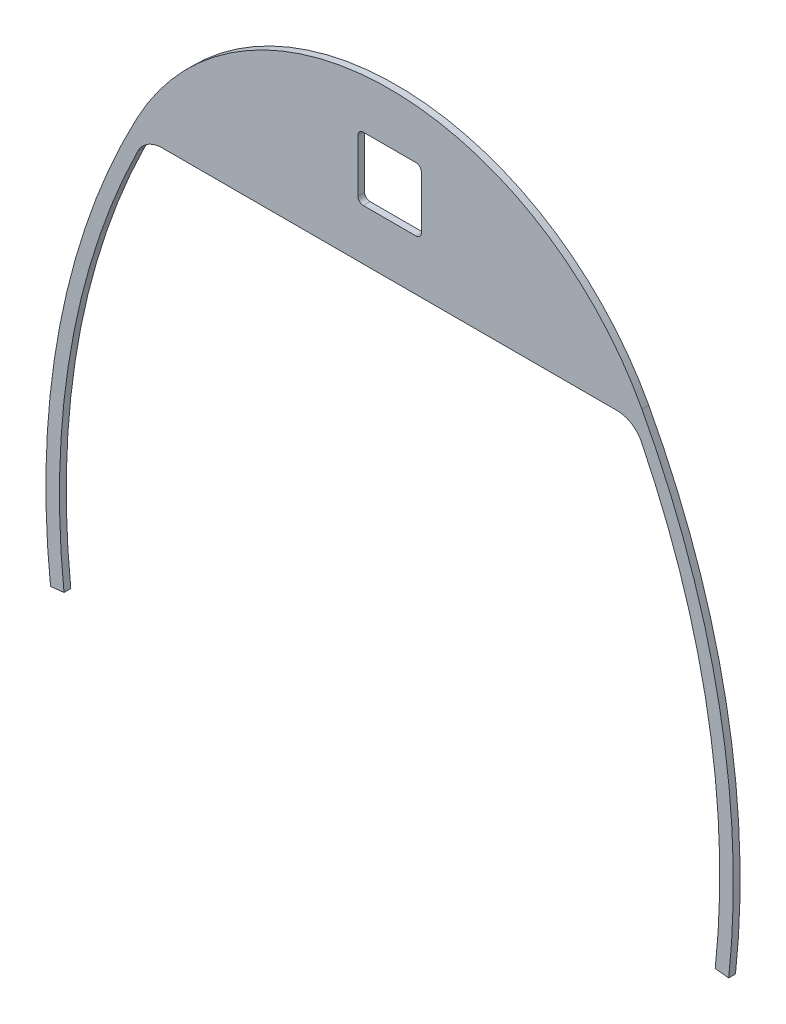
ISO-10303-21;
HEADER;
FILE_DESCRIPTION(('STEP AP214'),'2;1');
FILE_NAME('part.step','',(''),(''),'','','');
FILE_SCHEMA(('AUTOMOTIVE_DESIGN { 1 0 10303 214 1 1 1 1 }'));
ENDSEC;
DATA;
#1=APPLICATION_CONTEXT('core data for automotive mechanical design processes');
#2=APPLICATION_PROTOCOL_DEFINITION('international standard','automotive_design',2000,#1);
#3=PRODUCT_CONTEXT('',#1,'mechanical');
#4=PRODUCT('Part','Part','',(#3));
#5=PRODUCT_RELATED_PRODUCT_CATEGORY('part','',(#4));
#6=PRODUCT_DEFINITION_FORMATION('','',#4);
#7=PRODUCT_DEFINITION_CONTEXT('part definition',#1,'design');
#8=PRODUCT_DEFINITION('design','',#6,#7);
#9=PRODUCT_DEFINITION_SHAPE('','',#8);
#10=(LENGTH_UNIT() NAMED_UNIT(*) SI_UNIT(.MILLI.,.METRE.));
#11=(NAMED_UNIT(*) PLANE_ANGLE_UNIT() SI_UNIT($,.RADIAN.));
#12=(NAMED_UNIT(*) SI_UNIT($,.STERADIAN.) SOLID_ANGLE_UNIT());
#13=UNCERTAINTY_MEASURE_WITH_UNIT(LENGTH_MEASURE(1.E-05),#10,'distance_accuracy_value','');
#14=(GEOMETRIC_REPRESENTATION_CONTEXT(3) GLOBAL_UNCERTAINTY_ASSIGNED_CONTEXT((#13)) GLOBAL_UNIT_ASSIGNED_CONTEXT((#10,
#11,#12)) REPRESENTATION_CONTEXT('',''));
#15=CARTESIAN_POINT('',(0.,0.,0.));
#16=DIRECTION('',(0.,0.,1.));
#17=DIRECTION('',(1.,0.,0.));
#18=AXIS2_PLACEMENT_3D('',#15,#16,#17);
#19=CARTESIAN_POINT('',(0.,146.394206229881,3.175));
#20=DIRECTION('',(0.,0.,-1.));
#21=DIRECTION('',(-1.,0.,0.));
#22=AXIS2_PLACEMENT_3D('',#19,#20,#21);
#23=CYLINDRICAL_SURFACE('',#22,133.951547172083);
#24=CARTESIAN_POINT('',(0.,146.394206229881,0.));
#25=DIRECTION('',(0.,0.,1.));
#26=DIRECTION('',(1.,0.,0.));
#27=AXIS2_PLACEMENT_3D('',#24,#25,#26);
#28=CIRCLE('',#27,133.951547172083);
#29=CARTESIAN_POINT('',(-118.128585461186,209.55,0.));
#30=VERTEX_POINT('',#29);
#31=CARTESIAN_POINT('',(118.128585461186,209.55,0.));
#32=VERTEX_POINT('',#31);
#33=EDGE_CURVE('E195',#30,#32,#28,.F.);
#34=ORIENTED_EDGE('',*,*,#33,.F.);
#35=DIRECTION('',(0.,0.,-1.));
#36=VECTOR('',#35,1.);
#37=CARTESIAN_POINT('',(-118.128585461186,209.55,3.175));
#38=LINE('',#37,#36);
#39=CARTESIAN_POINT('',(-118.128585461186,209.55,3.175));
#40=VERTEX_POINT('',#39);
#41=EDGE_CURVE('E190',#40,#30,#38,.T.);
#42=ORIENTED_EDGE('',*,*,#41,.F.);
#43=CARTESIAN_POINT('',(0.,146.394206229881,3.175));
#44=DIRECTION('',(0.,0.,1.));
#45=DIRECTION('',(1.,0.,0.));
#46=AXIS2_PLACEMENT_3D('',#43,#44,#45);
#47=CIRCLE('',#46,133.951547172083);
#48=CARTESIAN_POINT('',(118.128585461186,209.55,3.175));
#49=VERTEX_POINT('',#48);
#50=EDGE_CURVE('E193',#40,#49,#47,.F.);
#51=ORIENTED_EDGE('',*,*,#50,.T.);
#52=DIRECTION('',(0.,0.,-1.));
#53=VECTOR('',#52,1.);
#54=CARTESIAN_POINT('',(118.128585461186,209.55,3.175));
#55=LINE('',#54,#53);
#56=EDGE_CURVE('E199',#49,#32,#55,.T.);
#57=ORIENTED_EDGE('',*,*,#56,.T.);
#58=EDGE_LOOP('',(#34,#42,#51,#57));
#59=FACE_BOUND('',#58,.T.);
#60=ADVANCED_FACE('F67',(#59),#23,.T.);
#61=CARTESIAN_POINT('',(0.,0.,3.175));
#62=DIRECTION('',(0.,0.,1.));
#63=DIRECTION('',(1.,0.,0.));
#64=AXIS2_PLACEMENT_3D('',#61,#62,#63);
#65=PLANE('',#64);
#66=DIRECTION('',(0.,1.,0.));
#67=VECTOR('',#66,1.);
#68=CARTESIAN_POINT('',(14.859,256.631876700982,3.175));
#69=LINE('',#68,#67);
#70=CARTESIAN_POINT('',(14.859,229.453876700982,3.175));
#71=VERTEX_POINT('',#70);
#72=CARTESIAN_POINT('',(14.859,254.091876700982,3.175));
#73=VERTEX_POINT('',#72);
#74=EDGE_CURVE('E499',#71,#73,#69,.T.);
#75=ORIENTED_EDGE('',*,*,#74,.F.);
#76=CARTESIAN_POINT('',(12.319,229.453876700982,3.175));
#77=DIRECTION('',(0.,0.,1.));
#78=DIRECTION('',(1.,0.,0.));
#79=AXIS2_PLACEMENT_3D('',#76,#77,#78);
#80=CIRCLE('',#79,2.54);
#81=CARTESIAN_POINT('',(12.319,226.913876700982,3.175));
#82=VERTEX_POINT('',#81);
#83=EDGE_CURVE('E279',#71,#82,#80,.F.);
#84=ORIENTED_EDGE('',*,*,#83,.T.);
#85=DIRECTION('',(1.,0.,0.));
#86=VECTOR('',#85,1.);
#87=CARTESIAN_POINT('',(-14.859,226.913876700982,3.175));
#88=LINE('',#87,#86);
#89=CARTESIAN_POINT('',(-12.319,226.913876700982,3.175));
#90=VERTEX_POINT('',#89);
#91=EDGE_CURVE('E516',#90,#82,#88,.T.);
#92=ORIENTED_EDGE('',*,*,#91,.F.);
#93=CARTESIAN_POINT('',(-12.319,229.453876700982,3.175));
#94=DIRECTION('',(0.,0.,1.));
#95=DIRECTION('',(1.,0.,0.));
#96=AXIS2_PLACEMENT_3D('',#93,#94,#95);
#97=CIRCLE('',#96,2.54);
#98=CARTESIAN_POINT('',(-14.859,229.453876700982,3.175));
#99=VERTEX_POINT('',#98);
#100=EDGE_CURVE('E291',#90,#99,#97,.F.);
#101=ORIENTED_EDGE('',*,*,#100,.T.);
#102=DIRECTION('',(0.,-1.,0.));
#103=VECTOR('',#102,1.);
#104=CARTESIAN_POINT('',(-14.859,256.631876700982,3.175));
#105=LINE('',#104,#103);
#106=CARTESIAN_POINT('',(-14.859,254.091876700982,3.175));
#107=VERTEX_POINT('',#106);
#108=EDGE_CURVE('E508',#107,#99,#105,.T.);
#109=ORIENTED_EDGE('',*,*,#108,.F.);
#110=CARTESIAN_POINT('',(-12.319,254.091876700982,3.175));
#111=DIRECTION('',(0.,0.,1.));
#112=DIRECTION('',(1.,0.,0.));
#113=AXIS2_PLACEMENT_3D('',#110,#111,#112);
#114=CIRCLE('',#113,2.54);
#115=CARTESIAN_POINT('',(-12.319,256.631876700982,3.175));
#116=VERTEX_POINT('',#115);
#117=EDGE_CURVE('E287',#107,#116,#114,.F.);
#118=ORIENTED_EDGE('',*,*,#117,.T.);
#119=DIRECTION('',(-1.,0.,0.));
#120=VECTOR('',#119,1.);
#121=CARTESIAN_POINT('',(-14.859,256.631876700982,3.175));
#122=LINE('',#121,#120);
#123=CARTESIAN_POINT('',(12.319,256.631876700982,3.175));
#124=VERTEX_POINT('',#123);
#125=EDGE_CURVE('E504',#124,#116,#122,.T.);
#126=ORIENTED_EDGE('',*,*,#125,.F.);
#127=CARTESIAN_POINT('',(12.319,254.091876700982,3.175));
#128=DIRECTION('',(0.,0.,1.));
#129=DIRECTION('',(1.,0.,0.));
#130=AXIS2_PLACEMENT_3D('',#127,#128,#129);
#131=CIRCLE('',#130,2.54);
#132=EDGE_CURVE('E283',#124,#73,#131,.F.);
#133=ORIENTED_EDGE('',*,*,#132,.T.);
#134=EDGE_LOOP('',(#75,#84,#92,#101,#109,#118,#126,#133));
#135=FACE_BOUND('',#134,.T.);
#136=ORIENTED_EDGE('',*,*,#50,.F.);
#137=CARTESIAN_POINT('',(201.066245881437,38.8969538972305,3.175));
#138=DIRECTION('',(0.,0.,1.));
#139=DIRECTION('',(1.,0.,0.));
#140=AXIS2_PLACEMENT_3D('',#137,#138,#139);
#141=CIRCLE('',#140,361.95);
#142=CARTESIAN_POINT('',(-158.711897247883,-0.69458846245031,3.175));
#143=VERTEX_POINT('',#142);
#144=EDGE_CURVE('E202',#40,#143,#141,.T.);
#145=ORIENTED_EDGE('',*,*,#144,.T.);
#146=DIRECTION('',(0.993999566595719,0.109384009834719,0.));
#147=VECTOR('',#146,1.);
#148=CARTESIAN_POINT('',(-158.711897247883,-0.69458846245047,3.175));
#149=LINE('',#148,#147);
#150=CARTESIAN_POINT('',(-152.4,0.,3.175));
#151=VERTEX_POINT('',#150);
#152=EDGE_CURVE('E210',#143,#151,#149,.T.);
#153=ORIENTED_EDGE('',*,*,#152,.T.);
#154=CARTESIAN_POINT('',(201.066245881437,38.8969538972305,3.175));
#155=DIRECTION('',(0.,0.,1.));
#156=DIRECTION('',(1.,0.,0.));
#157=AXIS2_PLACEMENT_3D('',#154,#155,#156);
#158=CIRCLE('',#157,355.6);
#159=CARTESIAN_POINT('',(-117.891225788818,196.114927633436,3.175));
#160=VERTEX_POINT('',#159);
#161=EDGE_CURVE('E232',#160,#151,#158,.T.);
#162=ORIENTED_EDGE('',*,*,#161,.F.);
#163=CARTESIAN_POINT('',(-106.49988751488,190.5,3.175));
#164=DIRECTION('',(0.,0.,1.));
#165=DIRECTION('',(1.,0.,0.));
#166=AXIS2_PLACEMENT_3D('',#163,#164,#165);
#167=CIRCLE('',#166,12.7);
#168=CARTESIAN_POINT('',(-106.49988751488,203.2,3.175));
#169=VERTEX_POINT('',#168);
#170=EDGE_CURVE('E12',#160,#169,#167,.F.);
#171=ORIENTED_EDGE('',*,*,#170,.T.);
#172=DIRECTION('',(1.,0.,0.));
#173=VECTOR('',#172,1.);
#174=CARTESIAN_POINT('',(-114.3,203.2,3.175));
#175=LINE('',#174,#173);
#176=CARTESIAN_POINT('',(106.49988751488,203.2,3.175));
#177=VERTEX_POINT('',#176);
#178=EDGE_CURVE('E229',#169,#177,#175,.T.);
#179=ORIENTED_EDGE('',*,*,#178,.T.);
#180=CARTESIAN_POINT('',(106.49988751488,190.5,3.175));
#181=DIRECTION('',(0.,0.,1.));
#182=DIRECTION('',(1.,0.,0.));
#183=AXIS2_PLACEMENT_3D('',#180,#181,#182);
#184=CIRCLE('',#183,12.7);
#185=CARTESIAN_POINT('',(117.891225788818,196.114927633436,3.175));
#186=VERTEX_POINT('',#185);
#187=EDGE_CURVE('E306',#177,#186,#184,.F.);
#188=ORIENTED_EDGE('',*,*,#187,.T.);
#189=CARTESIAN_POINT('',(-201.066245881437,38.8969538972305,3.175));
#190=DIRECTION('',(0.,0.,-1.));
#191=DIRECTION('',(-1.,0.,0.));
#192=AXIS2_PLACEMENT_3D('',#189,#190,#191);
#193=CIRCLE('',#192,355.6);
#194=CARTESIAN_POINT('',(152.4,0.,3.175));
#195=VERTEX_POINT('',#194);
#196=EDGE_CURVE('E227',#186,#195,#193,.T.);
#197=ORIENTED_EDGE('',*,*,#196,.T.);
#198=DIRECTION('',(0.993999566595714,-0.109384009834766,0.));
#199=VECTOR('',#198,1.);
#200=CARTESIAN_POINT('',(152.4,0.,3.175));
#201=LINE('',#200,#199);
#202=CARTESIAN_POINT('',(158.711897247883,-0.694588462450761,3.175));
#203=VERTEX_POINT('',#202);
#204=EDGE_CURVE('E224',#195,#203,#201,.T.);
#205=ORIENTED_EDGE('',*,*,#204,.T.);
#206=CARTESIAN_POINT('',(-201.066245881437,38.8969538972305,3.175));
#207=DIRECTION('',(0.,0.,-1.));
#208=DIRECTION('',(-1.,0.,0.));
#209=AXIS2_PLACEMENT_3D('',#206,#207,#208);
#210=CIRCLE('',#209,361.95);
#211=EDGE_CURVE('E215',#49,#203,#210,.T.);
#212=ORIENTED_EDGE('',*,*,#211,.F.);
#213=EDGE_LOOP('',(#136,#145,#153,#162,#171,#179,#188,#197,#205,#212));
#214=FACE_BOUND('',#213,.T.);
#215=ADVANCED_FACE('F213',(#135,#214),#65,.T.);
#216=CARTESIAN_POINT('',(0.,0.,0.));
#217=DIRECTION('',(0.,0.,1.));
#218=DIRECTION('',(1.,0.,0.));
#219=AXIS2_PLACEMENT_3D('',#216,#217,#218);
#220=PLANE('',#219);
#221=DIRECTION('',(-1.,0.,0.));
#222=VECTOR('',#221,1.);
#223=CARTESIAN_POINT('',(-14.859,226.913876700982,0.));
#224=LINE('',#223,#222);
#225=CARTESIAN_POINT('',(12.319,226.913876700982,0.));
#226=VERTEX_POINT('',#225);
#227=CARTESIAN_POINT('',(-12.319,226.913876700982,0.));
#228=VERTEX_POINT('',#227);
#229=EDGE_CURVE('E511',#226,#228,#224,.T.);
#230=ORIENTED_EDGE('',*,*,#229,.F.);
#231=CARTESIAN_POINT('',(12.319,229.453876700982,0.));
#232=DIRECTION('',(0.,0.,1.));
#233=DIRECTION('',(1.,0.,0.));
#234=AXIS2_PLACEMENT_3D('',#231,#232,#233);
#235=CIRCLE('',#234,2.54);
#236=CARTESIAN_POINT('',(14.859,229.453876700982,0.));
#237=VERTEX_POINT('',#236);
#238=EDGE_CURVE('E281',#226,#237,#235,.T.);
#239=ORIENTED_EDGE('',*,*,#238,.T.);
#240=DIRECTION('',(0.,-1.,0.));
#241=VECTOR('',#240,1.);
#242=CARTESIAN_POINT('',(14.859,256.631876700982,0.));
#243=LINE('',#242,#241);
#244=CARTESIAN_POINT('',(14.859,254.091876700982,0.));
#245=VERTEX_POINT('',#244);
#246=EDGE_CURVE('E505',#245,#237,#243,.T.);
#247=ORIENTED_EDGE('',*,*,#246,.F.);
#248=CARTESIAN_POINT('',(12.319,254.091876700982,0.));
#249=DIRECTION('',(0.,0.,1.));
#250=DIRECTION('',(1.,0.,0.));
#251=AXIS2_PLACEMENT_3D('',#248,#249,#250);
#252=CIRCLE('',#251,2.54);
#253=CARTESIAN_POINT('',(12.319,256.631876700982,0.));
#254=VERTEX_POINT('',#253);
#255=EDGE_CURVE('E285',#245,#254,#252,.T.);
#256=ORIENTED_EDGE('',*,*,#255,.T.);
#257=DIRECTION('',(1.,0.,0.));
#258=VECTOR('',#257,1.);
#259=CARTESIAN_POINT('',(-14.859,256.631876700982,0.));
#260=LINE('',#259,#258);
#261=CARTESIAN_POINT('',(-12.319,256.631876700982,0.));
#262=VERTEX_POINT('',#261);
#263=EDGE_CURVE('E220',#262,#254,#260,.T.);
#264=ORIENTED_EDGE('',*,*,#263,.F.);
#265=CARTESIAN_POINT('',(-12.319,254.091876700982,0.));
#266=DIRECTION('',(0.,0.,1.));
#267=DIRECTION('',(1.,0.,0.));
#268=AXIS2_PLACEMENT_3D('',#265,#266,#267);
#269=CIRCLE('',#268,2.54);
#270=CARTESIAN_POINT('',(-14.859,254.091876700982,0.));
#271=VERTEX_POINT('',#270);
#272=EDGE_CURVE('E289',#262,#271,#269,.T.);
#273=ORIENTED_EDGE('',*,*,#272,.T.);
#274=DIRECTION('',(0.,1.,0.));
#275=VECTOR('',#274,1.);
#276=CARTESIAN_POINT('',(-14.859,256.631876700982,0.));
#277=LINE('',#276,#275);
#278=CARTESIAN_POINT('',(-14.859,229.453876700982,0.));
#279=VERTEX_POINT('',#278);
#280=EDGE_CURVE('E530',#279,#271,#277,.T.);
#281=ORIENTED_EDGE('',*,*,#280,.F.);
#282=CARTESIAN_POINT('',(-12.319,229.453876700982,0.));
#283=DIRECTION('',(0.,0.,1.));
#284=DIRECTION('',(1.,0.,0.));
#285=AXIS2_PLACEMENT_3D('',#282,#283,#284);
#286=CIRCLE('',#285,2.54);
#287=EDGE_CURVE('E293',#279,#228,#286,.T.);
#288=ORIENTED_EDGE('',*,*,#287,.T.);
#289=EDGE_LOOP('',(#230,#239,#247,#256,#264,#273,#281,#288));
#290=FACE_BOUND('',#289,.T.);
#291=ORIENTED_EDGE('',*,*,#33,.T.);
#292=CARTESIAN_POINT('',(-201.066245881437,38.8969538972305,0.));
#293=DIRECTION('',(0.,0.,-1.));
#294=DIRECTION('',(-1.,0.,0.));
#295=AXIS2_PLACEMENT_3D('',#292,#293,#294);
#296=CIRCLE('',#295,361.95);
#297=CARTESIAN_POINT('',(158.711897247883,-0.694588462450761,0.));
#298=VERTEX_POINT('',#297);
#299=EDGE_CURVE('E235',#32,#298,#296,.T.);
#300=ORIENTED_EDGE('',*,*,#299,.T.);
#301=DIRECTION('',(0.993999566595714,-0.109384009834766,0.));
#302=VECTOR('',#301,1.);
#303=CARTESIAN_POINT('',(152.4,0.,0.));
#304=LINE('',#303,#302);
#305=CARTESIAN_POINT('',(152.4,0.,0.));
#306=VERTEX_POINT('',#305);
#307=EDGE_CURVE('E238',#306,#298,#304,.T.);
#308=ORIENTED_EDGE('',*,*,#307,.F.);
#309=CARTESIAN_POINT('',(-201.066245881437,38.8969538972305,0.));
#310=DIRECTION('',(0.,0.,-1.));
#311=DIRECTION('',(-1.,0.,0.));
#312=AXIS2_PLACEMENT_3D('',#309,#310,#311);
#313=CIRCLE('',#312,355.6);
#314=CARTESIAN_POINT('',(117.891225788818,196.114927633436,0.));
#315=VERTEX_POINT('',#314);
#316=EDGE_CURVE('E241',#315,#306,#313,.T.);
#317=ORIENTED_EDGE('',*,*,#316,.F.);
#318=CARTESIAN_POINT('',(106.49988751488,190.5,0.));
#319=DIRECTION('',(0.,0.,1.));
#320=DIRECTION('',(1.,0.,0.));
#321=AXIS2_PLACEMENT_3D('',#318,#319,#320);
#322=CIRCLE('',#321,12.7);
#323=CARTESIAN_POINT('',(106.49988751488,203.2,0.));
#324=VERTEX_POINT('',#323);
#325=EDGE_CURVE('E304',#315,#324,#322,.T.);
#326=ORIENTED_EDGE('',*,*,#325,.T.);
#327=DIRECTION('',(1.,0.,0.));
#328=VECTOR('',#327,1.);
#329=CARTESIAN_POINT('',(-114.3,203.2,0.));
#330=LINE('',#329,#328);
#331=CARTESIAN_POINT('',(-106.49988751488,203.2,0.));
#332=VERTEX_POINT('',#331);
#333=EDGE_CURVE('E243',#332,#324,#330,.T.);
#334=ORIENTED_EDGE('',*,*,#333,.F.);
#335=CARTESIAN_POINT('',(-106.49988751488,190.5,0.));
#336=DIRECTION('',(0.,0.,1.));
#337=DIRECTION('',(1.,0.,0.));
#338=AXIS2_PLACEMENT_3D('',#335,#336,#337);
#339=CIRCLE('',#338,12.7);
#340=CARTESIAN_POINT('',(-117.891225788818,196.114927633436,0.));
#341=VERTEX_POINT('',#340);
#342=EDGE_CURVE('E75',#332,#341,#339,.T.);
#343=ORIENTED_EDGE('',*,*,#342,.T.);
#344=CARTESIAN_POINT('',(201.066245881437,38.8969538972305,0.));
#345=DIRECTION('',(0.,0.,1.));
#346=DIRECTION('',(1.,0.,0.));
#347=AXIS2_PLACEMENT_3D('',#344,#345,#346);
#348=CIRCLE('',#347,355.6);
#349=CARTESIAN_POINT('',(-152.4,0.,0.));
#350=VERTEX_POINT('',#349);
#351=EDGE_CURVE('E246',#341,#350,#348,.T.);
#352=ORIENTED_EDGE('',*,*,#351,.T.);
#353=DIRECTION('',(0.993999566595719,0.109384009834719,0.));
#354=VECTOR('',#353,1.);
#355=CARTESIAN_POINT('',(-158.711897247883,-0.69458846245047,0.));
#356=LINE('',#355,#354);
#357=CARTESIAN_POINT('',(-158.711897247883,-0.69458846245031,0.));
#358=VERTEX_POINT('',#357);
#359=EDGE_CURVE('E248',#358,#350,#356,.T.);
#360=ORIENTED_EDGE('',*,*,#359,.F.);
#361=CARTESIAN_POINT('',(201.066245881437,38.8969538972305,0.));
#362=DIRECTION('',(0.,0.,1.));
#363=DIRECTION('',(1.,0.,0.));
#364=AXIS2_PLACEMENT_3D('',#361,#362,#363);
#365=CIRCLE('',#364,361.95);
#366=EDGE_CURVE('E225',#30,#358,#365,.T.);
#367=ORIENTED_EDGE('',*,*,#366,.F.);
#368=EDGE_LOOP('',(#291,#300,#308,#317,#326,#334,#343,#352,#360,#367));
#369=FACE_BOUND('',#368,.T.);
#370=ADVANCED_FACE('F319',(#290,#369),#220,.F.);
#371=CARTESIAN_POINT('',(201.066245881437,38.8969538972305,3.175));
#372=DIRECTION('',(0.,0.,-1.));
#373=DIRECTION('',(-1.,0.,0.));
#374=AXIS2_PLACEMENT_3D('',#371,#372,#373);
#375=CYLINDRICAL_SURFACE('',#374,361.95);
#376=ORIENTED_EDGE('',*,*,#366,.T.);
#377=DIRECTION('',(0.,0.,-1.));
#378=VECTOR('',#377,1.);
#379=CARTESIAN_POINT('',(-158.711897247883,-0.69458846245031,3.175));
#380=LINE('',#379,#378);
#381=EDGE_CURVE('E205',#143,#358,#380,.T.);
#382=ORIENTED_EDGE('',*,*,#381,.F.);
#383=ORIENTED_EDGE('',*,*,#144,.F.);
#384=ORIENTED_EDGE('',*,*,#41,.T.);
#385=EDGE_LOOP('',(#376,#382,#383,#384));
#386=FACE_BOUND('',#385,.T.);
#387=ADVANCED_FACE('F203',(#386),#375,.T.);
#388=CARTESIAN_POINT('',(-158.711897247883,-0.69458846245047,3.175));
#389=DIRECTION('',(-0.109384009834719,0.993999566595719,0.));
#390=DIRECTION('',(-0.993999566595719,-0.109384009834719,0.));
#391=AXIS2_PLACEMENT_3D('',#388,#389,#390);
#392=PLANE('',#391);
#393=ORIENTED_EDGE('',*,*,#359,.T.);
#394=DIRECTION('',(0.,0.,-1.));
#395=VECTOR('',#394,1.);
#396=CARTESIAN_POINT('',(-152.4,0.,3.175));
#397=LINE('',#396,#395);
#398=EDGE_CURVE('E253',#151,#350,#397,.T.);
#399=ORIENTED_EDGE('',*,*,#398,.F.);
#400=ORIENTED_EDGE('',*,*,#152,.F.);
#401=ORIENTED_EDGE('',*,*,#381,.T.);
#402=EDGE_LOOP('',(#393,#399,#400,#401));
#403=FACE_BOUND('',#402,.T.);
#404=ADVANCED_FACE('F330',(#403),#392,.F.);
#405=CARTESIAN_POINT('',(201.066245881437,38.8969538972305,3.175));
#406=DIRECTION('',(0.,0.,-1.));
#407=DIRECTION('',(-1.,0.,0.));
#408=AXIS2_PLACEMENT_3D('',#405,#406,#407);
#409=CYLINDRICAL_SURFACE('',#408,355.6);
#410=ORIENTED_EDGE('',*,*,#351,.F.);
#411=DIRECTION('',(0.,0.,-1.));
#412=VECTOR('',#411,1.);
#413=CARTESIAN_POINT('',(-117.891225788818,196.114927633436,3.175));
#414=LINE('',#413,#412);
#415=EDGE_CURVE('E82',#341,#160,#414,.F.);
#416=ORIENTED_EDGE('',*,*,#415,.T.);
#417=ORIENTED_EDGE('',*,*,#161,.T.);
#418=ORIENTED_EDGE('',*,*,#398,.T.);
#419=EDGE_LOOP('',(#410,#416,#417,#418));
#420=FACE_BOUND('',#419,.T.);
#421=ADVANCED_FACE('F327',(#420),#409,.F.);
#422=CARTESIAN_POINT('',(-114.3,203.2,3.175));
#423=DIRECTION('',(0.,1.,0.));
#424=DIRECTION('',(0.,0.,1.));
#425=AXIS2_PLACEMENT_3D('',#422,#423,#424);
#426=PLANE('',#425);
#427=ORIENTED_EDGE('',*,*,#333,.T.);
#428=DIRECTION('',(0.,0.,1.));
#429=VECTOR('',#428,1.);
#430=CARTESIAN_POINT('',(106.49988751488,203.2,3.175));
#431=LINE('',#430,#429);
#432=EDGE_CURVE('E301',#324,#177,#431,.T.);
#433=ORIENTED_EDGE('',*,*,#432,.T.);
#434=ORIENTED_EDGE('',*,*,#178,.F.);
#435=DIRECTION('',(0.,0.,-1.));
#436=VECTOR('',#435,1.);
#437=CARTESIAN_POINT('',(-106.49988751488,203.2,3.175));
#438=LINE('',#437,#436);
#439=EDGE_CURVE('E298',#169,#332,#438,.T.);
#440=ORIENTED_EDGE('',*,*,#439,.T.);
#441=EDGE_LOOP('',(#427,#433,#434,#440));
#442=FACE_BOUND('',#441,.T.);
#443=ADVANCED_FACE('F322',(#442),#426,.F.);
#444=CARTESIAN_POINT('',(-201.066245881437,38.8969538972305,3.175));
#445=DIRECTION('',(0.,0.,-1.));
#446=DIRECTION('',(-1.,0.,0.));
#447=AXIS2_PLACEMENT_3D('',#444,#445,#446);
#448=CYLINDRICAL_SURFACE('',#447,355.6);
#449=ORIENTED_EDGE('',*,*,#196,.F.);
#450=DIRECTION('',(0.,0.,-1.));
#451=VECTOR('',#450,1.);
#452=CARTESIAN_POINT('',(117.891225788818,196.114927633436,3.175));
#453=LINE('',#452,#451);
#454=EDGE_CURVE('E295',#186,#315,#453,.T.);
#455=ORIENTED_EDGE('',*,*,#454,.T.);
#456=ORIENTED_EDGE('',*,*,#316,.T.);
#457=DIRECTION('',(0.,0.,-1.));
#458=VECTOR('',#457,1.);
#459=CARTESIAN_POINT('',(152.4,0.,3.175));
#460=LINE('',#459,#458);
#461=EDGE_CURVE('E256',#195,#306,#460,.T.);
#462=ORIENTED_EDGE('',*,*,#461,.F.);
#463=EDGE_LOOP('',(#449,#455,#456,#462));
#464=FACE_BOUND('',#463,.T.);
#465=ADVANCED_FACE('F315',(#464),#448,.F.);
#466=CARTESIAN_POINT('',(152.4,0.,3.175));
#467=DIRECTION('',(0.109384009834766,0.993999566595714,0.));
#468=DIRECTION('',(-0.993999566595714,0.109384009834766,0.));
#469=AXIS2_PLACEMENT_3D('',#466,#467,#468);
#470=PLANE('',#469);
#471=ORIENTED_EDGE('',*,*,#307,.T.);
#472=DIRECTION('',(0.,0.,-1.));
#473=VECTOR('',#472,1.);
#474=CARTESIAN_POINT('',(158.711897247883,-0.694588462450761,3.175));
#475=LINE('',#474,#473);
#476=EDGE_CURVE('E209',#203,#298,#475,.T.);
#477=ORIENTED_EDGE('',*,*,#476,.F.);
#478=ORIENTED_EDGE('',*,*,#204,.F.);
#479=ORIENTED_EDGE('',*,*,#461,.T.);
#480=EDGE_LOOP('',(#471,#477,#478,#479));
#481=FACE_BOUND('',#480,.T.);
#482=ADVANCED_FACE('F336',(#481),#470,.F.);
#483=CARTESIAN_POINT('',(-201.066245881437,38.8969538972305,3.175));
#484=DIRECTION('',(0.,0.,-1.));
#485=DIRECTION('',(-1.,0.,0.));
#486=AXIS2_PLACEMENT_3D('',#483,#484,#485);
#487=CYLINDRICAL_SURFACE('',#486,361.95);
#488=ORIENTED_EDGE('',*,*,#299,.F.);
#489=ORIENTED_EDGE('',*,*,#56,.F.);
#490=ORIENTED_EDGE('',*,*,#211,.T.);
#491=ORIENTED_EDGE('',*,*,#476,.T.);
#492=EDGE_LOOP('',(#488,#489,#490,#491));
#493=FACE_BOUND('',#492,.T.);
#494=ADVANCED_FACE('F333',(#493),#487,.T.);
#495=CARTESIAN_POINT('',(14.859,256.631876700982,-0.00100000000000013));
#496=DIRECTION('',(1.,0.,0.));
#497=DIRECTION('',(0.,1.,0.));
#498=AXIS2_PLACEMENT_3D('',#495,#496,#497);
#499=PLANE('',#498);
#500=ORIENTED_EDGE('',*,*,#246,.T.);
#501=DIRECTION('',(0.,0.,1.));
#502=VECTOR('',#501,1.);
#503=CARTESIAN_POINT('',(14.859,229.453876700982,3.175));
#504=LINE('',#503,#502);
#505=EDGE_CURVE('E261',#237,#71,#504,.T.);
#506=ORIENTED_EDGE('',*,*,#505,.T.);
#507=ORIENTED_EDGE('',*,*,#74,.T.);
#508=DIRECTION('',(0.,0.,1.));
#509=VECTOR('',#508,1.);
#510=CARTESIAN_POINT('',(14.859,254.091876700982,0.));
#511=LINE('',#510,#509);
#512=EDGE_CURVE('E198',#73,#245,#511,.F.);
#513=ORIENTED_EDGE('',*,*,#512,.T.);
#514=EDGE_LOOP('',(#500,#506,#507,#513));
#515=FACE_BOUND('',#514,.T.);
#516=ADVANCED_FACE('F343',(#515),#499,.F.);
#517=CARTESIAN_POINT('',(-14.859,226.913876700982,-0.00100000000000013));
#518=DIRECTION('',(0.,-1.,0.));
#519=DIRECTION('',(0.,0.,-1.));
#520=AXIS2_PLACEMENT_3D('',#517,#518,#519);
#521=PLANE('',#520);
#522=ORIENTED_EDGE('',*,*,#91,.T.);
#523=DIRECTION('',(0.,0.,1.));
#524=VECTOR('',#523,1.);
#525=CARTESIAN_POINT('',(12.319,226.913876700982,0.));
#526=LINE('',#525,#524);
#527=EDGE_CURVE('E267',#82,#226,#526,.F.);
#528=ORIENTED_EDGE('',*,*,#527,.T.);
#529=ORIENTED_EDGE('',*,*,#229,.T.);
#530=DIRECTION('',(0.,0.,1.));
#531=VECTOR('',#530,1.);
#532=CARTESIAN_POINT('',(-12.319,226.913876700982,3.175));
#533=LINE('',#532,#531);
#534=EDGE_CURVE('E264',#228,#90,#533,.T.);
#535=ORIENTED_EDGE('',*,*,#534,.T.);
#536=EDGE_LOOP('',(#522,#528,#529,#535));
#537=FACE_BOUND('',#536,.T.);
#538=ADVANCED_FACE('F433',(#537),#521,.F.);
#539=CARTESIAN_POINT('',(-14.859,256.631876700982,-0.00100000000000013));
#540=DIRECTION('',(-1.,0.,0.));
#541=DIRECTION('',(0.,-1.,0.));
#542=AXIS2_PLACEMENT_3D('',#539,#540,#541);
#543=PLANE('',#542);
#544=ORIENTED_EDGE('',*,*,#280,.T.);
#545=DIRECTION('',(0.,0.,1.));
#546=VECTOR('',#545,1.);
#547=CARTESIAN_POINT('',(-14.859,254.091876700982,3.175));
#548=LINE('',#547,#546);
#549=EDGE_CURVE('E276',#271,#107,#548,.T.);
#550=ORIENTED_EDGE('',*,*,#549,.T.);
#551=ORIENTED_EDGE('',*,*,#108,.T.);
#552=DIRECTION('',(0.,0.,1.));
#553=VECTOR('',#552,1.);
#554=CARTESIAN_POINT('',(-14.859,229.453876700982,0.));
#555=LINE('',#554,#553);
#556=EDGE_CURVE('E274',#99,#279,#555,.F.);
#557=ORIENTED_EDGE('',*,*,#556,.T.);
#558=EDGE_LOOP('',(#544,#550,#551,#557));
#559=FACE_BOUND('',#558,.T.);
#560=ADVANCED_FACE('F425',(#559),#543,.F.);
#561=CARTESIAN_POINT('',(-14.859,256.631876700982,-0.00100000000000013));
#562=DIRECTION('',(0.,1.,0.));
#563=DIRECTION('',(0.,0.,1.));
#564=AXIS2_PLACEMENT_3D('',#561,#562,#563);
#565=PLANE('',#564);
#566=ORIENTED_EDGE('',*,*,#263,.T.);
#567=DIRECTION('',(0.,0.,1.));
#568=VECTOR('',#567,1.);
#569=CARTESIAN_POINT('',(12.319,256.631876700982,3.175));
#570=LINE('',#569,#568);
#571=EDGE_CURVE('E271',#254,#124,#570,.T.);
#572=ORIENTED_EDGE('',*,*,#571,.T.);
#573=ORIENTED_EDGE('',*,*,#125,.T.);
#574=DIRECTION('',(0.,0.,1.));
#575=VECTOR('',#574,1.);
#576=CARTESIAN_POINT('',(-12.319,256.631876700982,0.));
#577=LINE('',#576,#575);
#578=EDGE_CURVE('E269',#116,#262,#577,.F.);
#579=ORIENTED_EDGE('',*,*,#578,.T.);
#580=EDGE_LOOP('',(#566,#572,#573,#579));
#581=FACE_BOUND('',#580,.T.);
#582=ADVANCED_FACE('F417',(#581),#565,.F.);
#583=CARTESIAN_POINT('',(12.319,229.453876700982,-0.00100000000000013));
#584=DIRECTION('',(0.,0.,-1.));
#585=DIRECTION('',(-1.,0.,0.));
#586=AXIS2_PLACEMENT_3D('',#583,#584,#585);
#587=CYLINDRICAL_SURFACE('',#586,2.54);
#588=ORIENTED_EDGE('',*,*,#238,.F.);
#589=ORIENTED_EDGE('',*,*,#527,.F.);
#590=ORIENTED_EDGE('',*,*,#83,.F.);
#591=ORIENTED_EDGE('',*,*,#505,.F.);
#592=EDGE_LOOP('',(#588,#589,#590,#591));
#593=FACE_BOUND('',#592,.T.);
#594=ADVANCED_FACE('F409',(#593),#587,.F.);
#595=CARTESIAN_POINT('',(12.319,254.091876700982,-0.00100000000000013));
#596=DIRECTION('',(0.,0.,-1.));
#597=DIRECTION('',(-1.,0.,0.));
#598=AXIS2_PLACEMENT_3D('',#595,#596,#597);
#599=CYLINDRICAL_SURFACE('',#598,2.54);
#600=ORIENTED_EDGE('',*,*,#255,.F.);
#601=ORIENTED_EDGE('',*,*,#512,.F.);
#602=ORIENTED_EDGE('',*,*,#132,.F.);
#603=ORIENTED_EDGE('',*,*,#571,.F.);
#604=EDGE_LOOP('',(#600,#601,#602,#603));
#605=FACE_BOUND('',#604,.T.);
#606=ADVANCED_FACE('F401',(#605),#599,.F.);
#607=CARTESIAN_POINT('',(-12.319,254.091876700982,-0.00100000000000013));
#608=DIRECTION('',(0.,0.,-1.));
#609=DIRECTION('',(-1.,0.,0.));
#610=AXIS2_PLACEMENT_3D('',#607,#608,#609);
#611=CYLINDRICAL_SURFACE('',#610,2.54);
#612=ORIENTED_EDGE('',*,*,#272,.F.);
#613=ORIENTED_EDGE('',*,*,#578,.F.);
#614=ORIENTED_EDGE('',*,*,#117,.F.);
#615=ORIENTED_EDGE('',*,*,#549,.F.);
#616=EDGE_LOOP('',(#612,#613,#614,#615));
#617=FACE_BOUND('',#616,.T.);
#618=ADVANCED_FACE('F393',(#617),#611,.F.);
#619=CARTESIAN_POINT('',(-12.319,229.453876700982,-0.00100000000000013));
#620=DIRECTION('',(0.,0.,-1.));
#621=DIRECTION('',(-1.,0.,0.));
#622=AXIS2_PLACEMENT_3D('',#619,#620,#621);
#623=CYLINDRICAL_SURFACE('',#622,2.54);
#624=ORIENTED_EDGE('',*,*,#287,.F.);
#625=ORIENTED_EDGE('',*,*,#556,.F.);
#626=ORIENTED_EDGE('',*,*,#100,.F.);
#627=ORIENTED_EDGE('',*,*,#534,.F.);
#628=EDGE_LOOP('',(#624,#625,#626,#627));
#629=FACE_BOUND('',#628,.T.);
#630=ADVANCED_FACE('F378',(#629),#623,.F.);
#631=CARTESIAN_POINT('',(106.49988751488,190.5,3.175));
#632=DIRECTION('',(0.,0.,-1.));
#633=DIRECTION('',(-1.,0.,0.));
#634=AXIS2_PLACEMENT_3D('',#631,#632,#633);
#635=CYLINDRICAL_SURFACE('',#634,12.7);
#636=ORIENTED_EDGE('',*,*,#187,.F.);
#637=ORIENTED_EDGE('',*,*,#432,.F.);
#638=ORIENTED_EDGE('',*,*,#325,.F.);
#639=ORIENTED_EDGE('',*,*,#454,.F.);
#640=EDGE_LOOP('',(#636,#637,#638,#639));
#641=FACE_BOUND('',#640,.T.);
#642=ADVANCED_FACE('F318',(#641),#635,.F.);
#643=CARTESIAN_POINT('',(-106.49988751488,190.5,3.175));
#644=DIRECTION('',(0.,0.,-1.));
#645=DIRECTION('',(-1.,0.,0.));
#646=AXIS2_PLACEMENT_3D('',#643,#644,#645);
#647=CYLINDRICAL_SURFACE('',#646,12.7);
#648=ORIENTED_EDGE('',*,*,#170,.F.);
#649=ORIENTED_EDGE('',*,*,#415,.F.);
#650=ORIENTED_EDGE('',*,*,#342,.F.);
#651=ORIENTED_EDGE('',*,*,#439,.F.);
#652=EDGE_LOOP('',(#648,#649,#650,#651));
#653=FACE_BOUND('',#652,.T.);
#654=ADVANCED_FACE('F69',(#653),#647,.F.);
#655=CLOSED_SHELL('',(#60,#215,#370,#387,#404,#421,#443,#465,#482,#494,#516,#538,#560,#582,#594,
#606,#618,#630,#642,#654));
#656=MANIFOLD_SOLID_BREP('B2',#655);
#657=ADVANCED_BREP_SHAPE_REPRESENTATION('',(#18,#656),#14);
#658=SHAPE_DEFINITION_REPRESENTATION(#9,#657);
ENDSEC;
END-ISO-10303-21;
